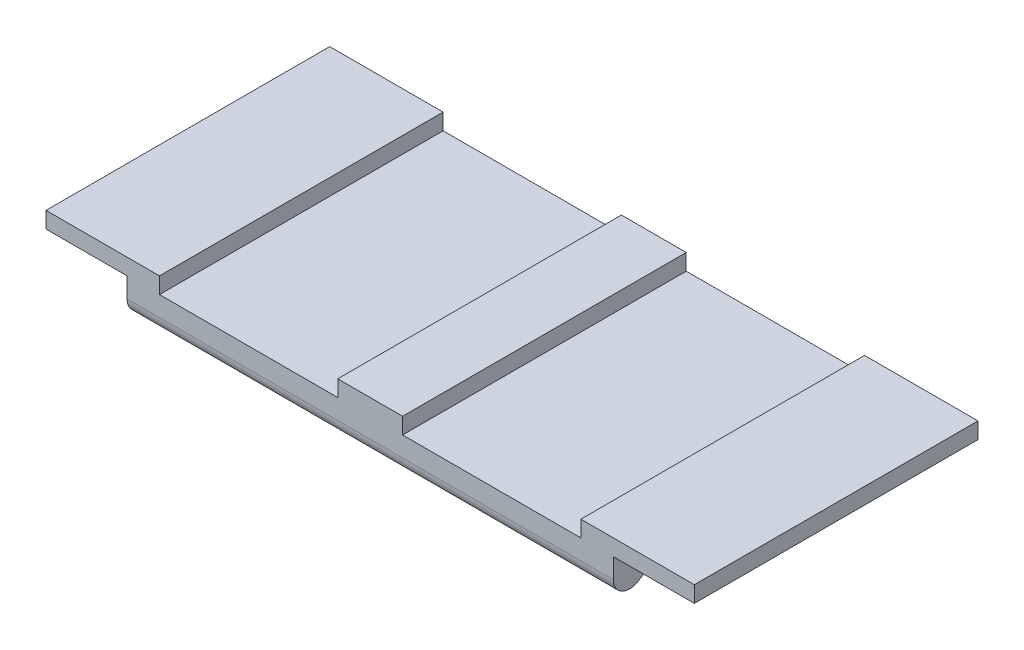
ISO-10303-21;
HEADER;
FILE_DESCRIPTION(('STEP AP214'),'2;1');
FILE_NAME('part.step','',(''),(''),'','','');
FILE_SCHEMA(('AUTOMOTIVE_DESIGN { 1 0 10303 214 1 1 1 1 }'));
ENDSEC;
DATA;
#1=APPLICATION_CONTEXT('core data for automotive mechanical design processes');
#2=APPLICATION_PROTOCOL_DEFINITION('international standard','automotive_design',2000,#1);
#3=PRODUCT_CONTEXT('',#1,'mechanical');
#4=PRODUCT('Part','Part','',(#3));
#5=PRODUCT_RELATED_PRODUCT_CATEGORY('part','',(#4));
#6=PRODUCT_DEFINITION_FORMATION('','',#4);
#7=PRODUCT_DEFINITION_CONTEXT('part definition',#1,'design');
#8=PRODUCT_DEFINITION('design','',#6,#7);
#9=PRODUCT_DEFINITION_SHAPE('','',#8);
#10=(LENGTH_UNIT() NAMED_UNIT(*) SI_UNIT(.MILLI.,.METRE.));
#11=(NAMED_UNIT(*) PLANE_ANGLE_UNIT() SI_UNIT($,.RADIAN.));
#12=(NAMED_UNIT(*) SI_UNIT($,.STERADIAN.) SOLID_ANGLE_UNIT());
#13=UNCERTAINTY_MEASURE_WITH_UNIT(LENGTH_MEASURE(1.E-05),#10,'distance_accuracy_value','');
#14=(GEOMETRIC_REPRESENTATION_CONTEXT(3) GLOBAL_UNCERTAINTY_ASSIGNED_CONTEXT((#13)) GLOBAL_UNIT_ASSIGNED_CONTEXT((#10,
#11,#12)) REPRESENTATION_CONTEXT('',''));
#15=CARTESIAN_POINT('',(0.,0.,0.));
#16=DIRECTION('',(0.,0.,1.));
#17=DIRECTION('',(1.,0.,0.));
#18=AXIS2_PLACEMENT_3D('',#15,#16,#17);
#19=CARTESIAN_POINT('',(30.,-8.,17.5));
#20=DIRECTION('',(1.,0.,0.));
#21=DIRECTION('',(0.,0.,-1.));
#22=AXIS2_PLACEMENT_3D('',#19,#20,#21);
#23=PLANE('',#22);
#24=DIRECTION('',(0.,1.,0.));
#25=VECTOR('',#24,1.);
#26=CARTESIAN_POINT('',(30.,-8.,-17.5));
#27=LINE('',#26,#25);
#28=CARTESIAN_POINT('',(30.,-4.46761924206188,-17.5));
#29=VERTEX_POINT('',#28);
#30=CARTESIAN_POINT('',(30.,-2.,-17.5));
#31=VERTEX_POINT('',#30);
#32=EDGE_CURVE('E309',#29,#31,#27,.T.);
#33=ORIENTED_EDGE('',*,*,#32,.T.);
#34=DIRECTION('',(0.,0.,1.));
#35=VECTOR('',#34,1.);
#36=CARTESIAN_POINT('',(30.,-2.,0.));
#37=LINE('',#36,#35);
#38=CARTESIAN_POINT('',(30.,-2.,17.5));
#39=VERTEX_POINT('',#38);
#40=EDGE_CURVE('E206',#31,#39,#37,.T.);
#41=ORIENTED_EDGE('',*,*,#40,.T.);
#42=DIRECTION('',(0.,1.,0.));
#43=VECTOR('',#42,1.);
#44=CARTESIAN_POINT('',(30.,-8.,17.5));
#45=LINE('',#44,#43);
#46=CARTESIAN_POINT('',(30.,-4.46761924206188,17.5));
#47=VERTEX_POINT('',#46);
#48=EDGE_CURVE('E312',#47,#39,#45,.T.);
#49=ORIENTED_EDGE('',*,*,#48,.F.);
#50=CARTESIAN_POINT('',(30.,-4.46761924206188,15.5));
#51=DIRECTION('',(1.,0.,0.));
#52=DIRECTION('',(0.,0.,-1.));
#53=AXIS2_PLACEMENT_3D('',#50,#51,#52);
#54=CIRCLE('',#53,2.);
#55=CARTESIAN_POINT('',(30.,-6.18260509348697,14.4710084891449));
#56=VERTEX_POINT('',#55);
#57=EDGE_CURVE('E339',#47,#56,#54,.T.);
#58=ORIENTED_EDGE('',*,*,#57,.T.);
#59=DIRECTION('',(0.,0.514495755427526,-0.857492925712544));
#60=VECTOR('',#59,1.);
#61=CARTESIAN_POINT('',(30.,-8.,17.5));
#62=LINE('',#61,#60);
#63=CARTESIAN_POINT('',(30.,-5.28501414857491,12.9750235809582));
#64=VERTEX_POINT('',#63);
#65=EDGE_CURVE('E299',#56,#64,#62,.T.);
#66=ORIENTED_EDGE('',*,*,#65,.T.);
#67=CARTESIAN_POINT('',(30.,-7.,11.9460320701031));
#68=DIRECTION('',(1.,0.,0.));
#69=DIRECTION('',(0.,0.,-1.));
#70=AXIS2_PLACEMENT_3D('',#67,#68,#69);
#71=CIRCLE('',#70,2.);
#72=CARTESIAN_POINT('',(30.,-5.,11.9460320701031));
#73=VERTEX_POINT('',#72);
#74=EDGE_CURVE('E346',#64,#73,#71,.F.);
#75=ORIENTED_EDGE('',*,*,#74,.T.);
#76=DIRECTION('',(0.,0.,-1.));
#77=VECTOR('',#76,1.);
#78=CARTESIAN_POINT('',(30.,-5.,17.5));
#79=LINE('',#78,#77);
#80=CARTESIAN_POINT('',(30.,-5.,-11.9460320701031));
#81=VERTEX_POINT('',#80);
#82=EDGE_CURVE('E308',#73,#81,#79,.T.);
#83=ORIENTED_EDGE('',*,*,#82,.T.);
#84=CARTESIAN_POINT('',(30.,-7.,-11.9460320701031));
#85=DIRECTION('',(1.,0.,0.));
#86=DIRECTION('',(0.,0.,-1.));
#87=AXIS2_PLACEMENT_3D('',#84,#85,#86);
#88=CIRCLE('',#87,2.);
#89=CARTESIAN_POINT('',(30.,-5.28501414857491,-12.9750235809582));
#90=VERTEX_POINT('',#89);
#91=EDGE_CURVE('E41',#81,#90,#88,.F.);
#92=ORIENTED_EDGE('',*,*,#91,.T.);
#93=DIRECTION('',(0.,0.514495755427527,0.857492925712544));
#94=VECTOR('',#93,1.);
#95=CARTESIAN_POINT('',(30.,7.44117647058825,8.23529411764705));
#96=LINE('',#95,#94);
#97=CARTESIAN_POINT('',(30.,-6.18260509348696,-14.471008489145));
#98=VERTEX_POINT('',#97);
#99=EDGE_CURVE('E296',#98,#90,#96,.T.);
#100=ORIENTED_EDGE('',*,*,#99,.F.);
#101=CARTESIAN_POINT('',(30.,-4.46761924206188,-15.5));
#102=DIRECTION('',(1.,0.,0.));
#103=DIRECTION('',(0.,0.,-1.));
#104=AXIS2_PLACEMENT_3D('',#101,#102,#103);
#105=CIRCLE('',#104,2.);
#106=EDGE_CURVE('E341',#98,#29,#105,.T.);
#107=ORIENTED_EDGE('',*,*,#106,.T.);
#108=EDGE_LOOP('',(#33,#41,#49,#58,#66,#75,#83,#92,#100,#107));
#109=FACE_BOUND('',#108,.T.);
#110=ADVANCED_FACE('F33',(#109),#23,.T.);
#111=CARTESIAN_POINT('',(30.,-8.,-17.5));
#112=DIRECTION('',(0.,0.,-1.));
#113=DIRECTION('',(-1.,0.,0.));
#114=AXIS2_PLACEMENT_3D('',#111,#112,#113);
#115=PLANE('',#114);
#116=DIRECTION('',(1.,0.,0.));
#117=VECTOR('',#116,1.);
#118=CARTESIAN_POINT('',(0.,-2.,-17.5));
#119=LINE('',#118,#117);
#120=CARTESIAN_POINT('',(-26.,-2.,-17.5));
#121=VERTEX_POINT('',#120);
#122=CARTESIAN_POINT('',(-4.,-2.,-17.5));
#123=VERTEX_POINT('',#122);
#124=EDGE_CURVE('E245',#121,#123,#119,.T.);
#125=ORIENTED_EDGE('',*,*,#124,.T.);
#126=DIRECTION('',(0.,-1.,0.));
#127=VECTOR('',#126,1.);
#128=CARTESIAN_POINT('',(-4.,0.,-17.5));
#129=LINE('',#128,#127);
#130=CARTESIAN_POINT('',(-4.,0.,-17.5));
#131=VERTEX_POINT('',#130);
#132=EDGE_CURVE('E239',#131,#123,#129,.T.);
#133=ORIENTED_EDGE('',*,*,#132,.F.);
#134=DIRECTION('',(-1.,0.,0.));
#135=VECTOR('',#134,1.);
#136=CARTESIAN_POINT('',(30.,0.,-17.5));
#137=LINE('',#136,#135);
#138=CARTESIAN_POINT('',(3.99999999999999,0.,-17.5));
#139=VERTEX_POINT('',#138);
#140=EDGE_CURVE('E196',#139,#131,#137,.T.);
#141=ORIENTED_EDGE('',*,*,#140,.F.);
#142=DIRECTION('',(0.,-1.,0.));
#143=VECTOR('',#142,1.);
#144=CARTESIAN_POINT('',(3.99999999999999,0.,-17.5));
#145=LINE('',#144,#143);
#146=CARTESIAN_POINT('',(3.99999999999999,-2.,-17.5));
#147=VERTEX_POINT('',#146);
#148=EDGE_CURVE('E267',#139,#147,#145,.T.);
#149=ORIENTED_EDGE('',*,*,#148,.T.);
#150=DIRECTION('',(-1.,0.,0.));
#151=VECTOR('',#150,1.);
#152=CARTESIAN_POINT('',(0.,-2.,-17.5));
#153=LINE('',#152,#151);
#154=CARTESIAN_POINT('',(26.,-2.,-17.5));
#155=VERTEX_POINT('',#154);
#156=EDGE_CURVE('E271',#155,#147,#153,.T.);
#157=ORIENTED_EDGE('',*,*,#156,.F.);
#158=DIRECTION('',(0.,-1.,0.));
#159=VECTOR('',#158,1.);
#160=CARTESIAN_POINT('',(26.,0.,-17.5));
#161=LINE('',#160,#159);
#162=CARTESIAN_POINT('',(26.,0.,-17.5));
#163=VERTEX_POINT('',#162);
#164=EDGE_CURVE('E191',#163,#155,#161,.T.);
#165=ORIENTED_EDGE('',*,*,#164,.F.);
#166=CARTESIAN_POINT('',(40.,0.,-17.5));
#167=VERTEX_POINT('',#166);
#168=EDGE_CURVE('E184',#167,#163,#137,.T.);
#169=ORIENTED_EDGE('',*,*,#168,.F.);
#170=DIRECTION('',(0.,-1.,0.));
#171=VECTOR('',#170,1.);
#172=CARTESIAN_POINT('',(40.,0.,-17.5));
#173=LINE('',#172,#171);
#174=CARTESIAN_POINT('',(40.,-2.,-17.5));
#175=VERTEX_POINT('',#174);
#176=EDGE_CURVE('E188',#167,#175,#173,.T.);
#177=ORIENTED_EDGE('',*,*,#176,.T.);
#178=DIRECTION('',(-1.,0.,0.));
#179=VECTOR('',#178,1.);
#180=CARTESIAN_POINT('',(40.,-2.,-17.5));
#181=LINE('',#180,#179);
#182=EDGE_CURVE('E216',#175,#31,#181,.T.);
#183=ORIENTED_EDGE('',*,*,#182,.T.);
#184=ORIENTED_EDGE('',*,*,#32,.F.);
#185=DIRECTION('',(-1.,0.,0.));
#186=VECTOR('',#185,1.);
#187=CARTESIAN_POINT('',(-30.,-4.46761924206187,-17.5));
#188=LINE('',#187,#186);
#189=CARTESIAN_POINT('',(-30.,-4.46761924206187,-17.5));
#190=VERTEX_POINT('',#189);
#191=EDGE_CURVE('E332',#29,#190,#188,.T.);
#192=ORIENTED_EDGE('',*,*,#191,.T.);
#193=DIRECTION('',(0.,1.,0.));
#194=VECTOR('',#193,1.);
#195=CARTESIAN_POINT('',(-30.,-8.,-17.5));
#196=LINE('',#195,#194);
#197=CARTESIAN_POINT('',(-30.,-2.,-17.5));
#198=VERTEX_POINT('',#197);
#199=EDGE_CURVE('E306',#190,#198,#196,.T.);
#200=ORIENTED_EDGE('',*,*,#199,.T.);
#201=DIRECTION('',(1.,0.,0.));
#202=VECTOR('',#201,1.);
#203=CARTESIAN_POINT('',(-40.,-2.,-17.5));
#204=LINE('',#203,#202);
#205=CARTESIAN_POINT('',(-40.,-2.,-17.5));
#206=VERTEX_POINT('',#205);
#207=EDGE_CURVE('E235',#206,#198,#204,.T.);
#208=ORIENTED_EDGE('',*,*,#207,.F.);
#209=DIRECTION('',(0.,-1.,0.));
#210=VECTOR('',#209,1.);
#211=CARTESIAN_POINT('',(-40.,0.,-17.5));
#212=LINE('',#211,#210);
#213=CARTESIAN_POINT('',(-40.,0.,-17.5));
#214=VERTEX_POINT('',#213);
#215=EDGE_CURVE('E220',#214,#206,#212,.T.);
#216=ORIENTED_EDGE('',*,*,#215,.F.);
#217=CARTESIAN_POINT('',(-26.,0.,-17.5));
#218=VERTEX_POINT('',#217);
#219=EDGE_CURVE('E198',#218,#214,#137,.T.);
#220=ORIENTED_EDGE('',*,*,#219,.F.);
#221=DIRECTION('',(0.,-1.,0.));
#222=VECTOR('',#221,1.);
#223=CARTESIAN_POINT('',(-26.,0.,-17.5));
#224=LINE('',#223,#222);
#225=EDGE_CURVE('E241',#218,#121,#224,.T.);
#226=ORIENTED_EDGE('',*,*,#225,.T.);
#227=EDGE_LOOP('',(#125,#133,#141,#149,#157,#165,#169,#177,#183,#184,#192,#200,#208,#216,#220,#226));
#228=FACE_BOUND('',#227,.T.);
#229=ADVANCED_FACE('F187',(#228),#115,.T.);
#230=CARTESIAN_POINT('',(30.,-8.,17.5));
#231=DIRECTION('',(0.,0.,1.));
#232=DIRECTION('',(1.,0.,0.));
#233=AXIS2_PLACEMENT_3D('',#230,#231,#232);
#234=PLANE('',#233);
#235=DIRECTION('',(1.,0.,0.));
#236=VECTOR('',#235,1.);
#237=CARTESIAN_POINT('',(30.,0.,17.5));
#238=LINE('',#237,#236);
#239=CARTESIAN_POINT('',(-4.,0.,17.5));
#240=VERTEX_POINT('',#239);
#241=CARTESIAN_POINT('',(3.99999999999999,0.,17.5));
#242=VERTEX_POINT('',#241);
#243=EDGE_CURVE('E304',#240,#242,#238,.T.);
#244=ORIENTED_EDGE('',*,*,#243,.F.);
#245=DIRECTION('',(0.,-1.,0.));
#246=VECTOR('',#245,1.);
#247=CARTESIAN_POINT('',(-4.,0.,17.5));
#248=LINE('',#247,#246);
#249=CARTESIAN_POINT('',(-4.,-2.,17.5));
#250=VERTEX_POINT('',#249);
#251=EDGE_CURVE('E248',#240,#250,#248,.T.);
#252=ORIENTED_EDGE('',*,*,#251,.T.);
#253=DIRECTION('',(1.,0.,0.));
#254=VECTOR('',#253,1.);
#255=CARTESIAN_POINT('',(0.,-2.,17.5));
#256=LINE('',#255,#254);
#257=CARTESIAN_POINT('',(-26.,-2.,17.5));
#258=VERTEX_POINT('',#257);
#259=EDGE_CURVE('E242',#258,#250,#256,.T.);
#260=ORIENTED_EDGE('',*,*,#259,.F.);
#261=DIRECTION('',(0.,-1.,0.));
#262=VECTOR('',#261,1.);
#263=CARTESIAN_POINT('',(-26.,0.,17.5));
#264=LINE('',#263,#262);
#265=CARTESIAN_POINT('',(-26.,0.,17.5));
#266=VERTEX_POINT('',#265);
#267=EDGE_CURVE('E251',#266,#258,#264,.T.);
#268=ORIENTED_EDGE('',*,*,#267,.F.);
#269=CARTESIAN_POINT('',(-40.,0.,17.5));
#270=VERTEX_POINT('',#269);
#271=EDGE_CURVE('E302',#270,#266,#238,.T.);
#272=ORIENTED_EDGE('',*,*,#271,.F.);
#273=DIRECTION('',(0.,1.,0.));
#274=VECTOR('',#273,1.);
#275=CARTESIAN_POINT('',(-40.,0.,17.5));
#276=LINE('',#275,#274);
#277=CARTESIAN_POINT('',(-40.,-2.,17.5));
#278=VERTEX_POINT('',#277);
#279=EDGE_CURVE('E225',#278,#270,#276,.T.);
#280=ORIENTED_EDGE('',*,*,#279,.F.);
#281=DIRECTION('',(1.,0.,0.));
#282=VECTOR('',#281,1.);
#283=CARTESIAN_POINT('',(-40.,-2.,17.5));
#284=LINE('',#283,#282);
#285=CARTESIAN_POINT('',(-30.,-2.,17.5));
#286=VERTEX_POINT('',#285);
#287=EDGE_CURVE('E231',#278,#286,#284,.T.);
#288=ORIENTED_EDGE('',*,*,#287,.T.);
#289=DIRECTION('',(0.,1.,0.));
#290=VECTOR('',#289,1.);
#291=CARTESIAN_POINT('',(-30.,-8.,17.5));
#292=LINE('',#291,#290);
#293=CARTESIAN_POINT('',(-30.,-4.46761924206188,17.5));
#294=VERTEX_POINT('',#293);
#295=EDGE_CURVE('E195',#294,#286,#292,.T.);
#296=ORIENTED_EDGE('',*,*,#295,.F.);
#297=DIRECTION('',(1.,0.,0.));
#298=VECTOR('',#297,1.);
#299=CARTESIAN_POINT('',(30.,-4.46761924206188,17.5));
#300=LINE('',#299,#298);
#301=EDGE_CURVE('E343',#294,#47,#300,.T.);
#302=ORIENTED_EDGE('',*,*,#301,.T.);
#303=ORIENTED_EDGE('',*,*,#48,.T.);
#304=DIRECTION('',(-1.,0.,0.));
#305=VECTOR('',#304,1.);
#306=CARTESIAN_POINT('',(40.,-2.,17.5));
#307=LINE('',#306,#305);
#308=CARTESIAN_POINT('',(40.,-2.,17.5));
#309=VERTEX_POINT('',#308);
#310=EDGE_CURVE('E48',#309,#39,#307,.T.);
#311=ORIENTED_EDGE('',*,*,#310,.F.);
#312=DIRECTION('',(0.,1.,0.));
#313=VECTOR('',#312,1.);
#314=CARTESIAN_POINT('',(40.,0.,17.5));
#315=LINE('',#314,#313);
#316=CARTESIAN_POINT('',(40.,0.,17.5));
#317=VERTEX_POINT('',#316);
#318=EDGE_CURVE('E211',#309,#317,#315,.T.);
#319=ORIENTED_EDGE('',*,*,#318,.T.);
#320=CARTESIAN_POINT('',(26.,0.,17.5));
#321=VERTEX_POINT('',#320);
#322=EDGE_CURVE('E210',#321,#317,#238,.T.);
#323=ORIENTED_EDGE('',*,*,#322,.F.);
#324=DIRECTION('',(0.,-1.,0.));
#325=VECTOR('',#324,1.);
#326=CARTESIAN_POINT('',(26.,0.,17.5));
#327=LINE('',#326,#325);
#328=CARTESIAN_POINT('',(26.,-2.,17.5));
#329=VERTEX_POINT('',#328);
#330=EDGE_CURVE('E238',#321,#329,#327,.T.);
#331=ORIENTED_EDGE('',*,*,#330,.T.);
#332=DIRECTION('',(-1.,0.,0.));
#333=VECTOR('',#332,1.);
#334=CARTESIAN_POINT('',(0.,-2.,17.5));
#335=LINE('',#334,#333);
#336=CARTESIAN_POINT('',(3.99999999999999,-2.,17.5));
#337=VERTEX_POINT('',#336);
#338=EDGE_CURVE('E268',#329,#337,#335,.T.);
#339=ORIENTED_EDGE('',*,*,#338,.T.);
#340=DIRECTION('',(0.,-1.,0.));
#341=VECTOR('',#340,1.);
#342=CARTESIAN_POINT('',(3.99999999999999,0.,17.5));
#343=LINE('',#342,#341);
#344=EDGE_CURVE('E276',#242,#337,#343,.T.);
#345=ORIENTED_EDGE('',*,*,#344,.F.);
#346=EDGE_LOOP('',(#244,#252,#260,#268,#272,#280,#288,#296,#302,#303,#311,#319,#323,#331,#339,#345));
#347=FACE_BOUND('',#346,.T.);
#348=ADVANCED_FACE('F382',(#347),#234,.T.);
#349=CARTESIAN_POINT('',(0.,0.,0.));
#350=DIRECTION('',(0.,1.,0.));
#351=DIRECTION('',(0.,0.,1.));
#352=AXIS2_PLACEMENT_3D('',#349,#350,#351);
#353=PLANE('',#352);
#354=ORIENTED_EDGE('',*,*,#140,.T.);
#355=DIRECTION('',(0.,0.,1.));
#356=VECTOR('',#355,1.);
#357=CARTESIAN_POINT('',(-4.,0.,-17.5));
#358=LINE('',#357,#356);
#359=EDGE_CURVE('E247',#131,#240,#358,.T.);
#360=ORIENTED_EDGE('',*,*,#359,.T.);
#361=ORIENTED_EDGE('',*,*,#243,.T.);
#362=DIRECTION('',(0.,0.,1.));
#363=VECTOR('',#362,1.);
#364=CARTESIAN_POINT('',(3.99999999999999,0.,-17.5));
#365=LINE('',#364,#363);
#366=EDGE_CURVE('E285',#139,#242,#365,.T.);
#367=ORIENTED_EDGE('',*,*,#366,.F.);
#368=EDGE_LOOP('',(#354,#360,#361,#367));
#369=FACE_BOUND('',#368,.T.);
#370=ADVANCED_FACE('F400',(#369),#353,.T.);
#371=ORIENTED_EDGE('',*,*,#168,.T.);
#372=DIRECTION('',(0.,0.,1.));
#373=VECTOR('',#372,1.);
#374=CARTESIAN_POINT('',(26.,0.,-17.5));
#375=LINE('',#374,#373);
#376=EDGE_CURVE('E273',#163,#321,#375,.T.);
#377=ORIENTED_EDGE('',*,*,#376,.T.);
#378=ORIENTED_EDGE('',*,*,#322,.T.);
#379=DIRECTION('',(0.,0.,-1.));
#380=VECTOR('',#379,1.);
#381=CARTESIAN_POINT('',(40.,0.,0.));
#382=LINE('',#381,#380);
#383=EDGE_CURVE('E203',#317,#167,#382,.T.);
#384=ORIENTED_EDGE('',*,*,#383,.T.);
#385=EDGE_LOOP('',(#371,#377,#378,#384));
#386=FACE_BOUND('',#385,.T.);
#387=ADVANCED_FACE('F208',(#386),#353,.T.);
#388=CARTESIAN_POINT('',(-30.,-8.,17.5));
#389=DIRECTION('',(-1.,0.,0.));
#390=DIRECTION('',(0.,0.,1.));
#391=AXIS2_PLACEMENT_3D('',#388,#389,#390);
#392=PLANE('',#391);
#393=DIRECTION('',(0.,0.,1.));
#394=VECTOR('',#393,1.);
#395=CARTESIAN_POINT('',(-30.,-2.,0.));
#396=LINE('',#395,#394);
#397=EDGE_CURVE('E56',#198,#286,#396,.T.);
#398=ORIENTED_EDGE('',*,*,#397,.F.);
#399=ORIENTED_EDGE('',*,*,#199,.F.);
#400=CARTESIAN_POINT('',(-30.,-4.46761924206187,-15.5));
#401=DIRECTION('',(-1.,0.,0.));
#402=DIRECTION('',(0.,0.,1.));
#403=AXIS2_PLACEMENT_3D('',#400,#401,#402);
#404=CIRCLE('',#403,2.);
#405=CARTESIAN_POINT('',(-30.,-6.18260509348696,-14.4710084891449));
#406=VERTEX_POINT('',#405);
#407=EDGE_CURVE('E337',#190,#406,#404,.T.);
#408=ORIENTED_EDGE('',*,*,#407,.T.);
#409=DIRECTION('',(0.,0.514495755427527,0.857492925712544));
#410=VECTOR('',#409,1.);
#411=CARTESIAN_POINT('',(-30.,1.83823529411765,-1.10294117647059));
#412=LINE('',#411,#410);
#413=CARTESIAN_POINT('',(-30.,-5.28501414857491,-12.9750235809582));
#414=VERTEX_POINT('',#413);
#415=EDGE_CURVE('E259',#406,#414,#412,.T.);
#416=ORIENTED_EDGE('',*,*,#415,.T.);
#417=CARTESIAN_POINT('',(-30.,-7.,-11.9460320701031));
#418=DIRECTION('',(-1.,0.,0.));
#419=DIRECTION('',(0.,0.,1.));
#420=AXIS2_PLACEMENT_3D('',#417,#418,#419);
#421=CIRCLE('',#420,2.);
#422=CARTESIAN_POINT('',(-30.,-5.,-11.9460320701031));
#423=VERTEX_POINT('',#422);
#424=EDGE_CURVE('E11',#414,#423,#421,.F.);
#425=ORIENTED_EDGE('',*,*,#424,.T.);
#426=DIRECTION('',(0.,0.,-1.));
#427=VECTOR('',#426,1.);
#428=CARTESIAN_POINT('',(-30.,-5.,0.));
#429=LINE('',#428,#427);
#430=CARTESIAN_POINT('',(-30.,-5.,11.9460320701031));
#431=VERTEX_POINT('',#430);
#432=EDGE_CURVE('E290',#431,#423,#429,.T.);
#433=ORIENTED_EDGE('',*,*,#432,.F.);
#434=CARTESIAN_POINT('',(-30.,-7.,11.9460320701031));
#435=DIRECTION('',(-1.,0.,0.));
#436=DIRECTION('',(0.,0.,1.));
#437=AXIS2_PLACEMENT_3D('',#434,#435,#436);
#438=CIRCLE('',#437,2.);
#439=CARTESIAN_POINT('',(-30.,-5.28501414857491,12.9750235809582));
#440=VERTEX_POINT('',#439);
#441=EDGE_CURVE('E348',#431,#440,#438,.F.);
#442=ORIENTED_EDGE('',*,*,#441,.T.);
#443=DIRECTION('',(0.,0.514495755427526,-0.857492925712544));
#444=VECTOR('',#443,1.);
#445=CARTESIAN_POINT('',(-30.,1.83823529411765,1.10294117647059));
#446=LINE('',#445,#444);
#447=CARTESIAN_POINT('',(-30.,-6.18260509348697,14.471008489145));
#448=VERTEX_POINT('',#447);
#449=EDGE_CURVE('E293',#448,#440,#446,.T.);
#450=ORIENTED_EDGE('',*,*,#449,.F.);
#451=CARTESIAN_POINT('',(-30.,-4.46761924206188,15.5));
#452=DIRECTION('',(-1.,0.,0.));
#453=DIRECTION('',(0.,0.,1.));
#454=AXIS2_PLACEMENT_3D('',#451,#452,#453);
#455=CIRCLE('',#454,2.);
#456=EDGE_CURVE('E335',#448,#294,#455,.T.);
#457=ORIENTED_EDGE('',*,*,#456,.T.);
#458=ORIENTED_EDGE('',*,*,#295,.T.);
#459=EDGE_LOOP('',(#398,#399,#408,#416,#425,#433,#442,#450,#457,#458));
#460=FACE_BOUND('',#459,.T.);
#461=ADVANCED_FACE('F363',(#460),#392,.T.);
#462=DIRECTION('',(0.,0.,1.));
#463=VECTOR('',#462,1.);
#464=CARTESIAN_POINT('',(-26.,0.,-17.5));
#465=LINE('',#464,#463);
#466=EDGE_CURVE('E262',#218,#266,#465,.T.);
#467=ORIENTED_EDGE('',*,*,#466,.F.);
#468=ORIENTED_EDGE('',*,*,#219,.T.);
#469=DIRECTION('',(0.,0.,-1.));
#470=VECTOR('',#469,1.);
#471=CARTESIAN_POINT('',(-40.,0.,0.));
#472=LINE('',#471,#470);
#473=EDGE_CURVE('E228',#270,#214,#472,.T.);
#474=ORIENTED_EDGE('',*,*,#473,.F.);
#475=ORIENTED_EDGE('',*,*,#271,.T.);
#476=EDGE_LOOP('',(#467,#468,#474,#475));
#477=FACE_BOUND('',#476,.T.);
#478=ADVANCED_FACE('F411',(#477),#353,.T.);
#479=CARTESIAN_POINT('',(-30.,1.83823529411765,1.10294117647059));
#480=DIRECTION('',(0.,-0.857492925712544,-0.514495755427526));
#481=DIRECTION('',(0.,0.514495755427526,-0.857492925712544));
#482=AXIS2_PLACEMENT_3D('',#479,#480,#481);
#483=PLANE('',#482);
#484=ORIENTED_EDGE('',*,*,#449,.T.);
#485=DIRECTION('',(1.,0.,0.));
#486=VECTOR('',#485,1.);
#487=CARTESIAN_POINT('',(30.,-5.28501414857491,12.9750235809582));
#488=LINE('',#487,#486);
#489=EDGE_CURVE('E320',#440,#64,#488,.T.);
#490=ORIENTED_EDGE('',*,*,#489,.T.);
#491=ORIENTED_EDGE('',*,*,#65,.F.);
#492=DIRECTION('',(1.,0.,0.));
#493=VECTOR('',#492,1.);
#494=CARTESIAN_POINT('',(-30.,-6.18260509348697,14.471008489145));
#495=LINE('',#494,#493);
#496=EDGE_CURVE('E318',#56,#448,#495,.F.);
#497=ORIENTED_EDGE('',*,*,#496,.T.);
#498=EDGE_LOOP('',(#484,#490,#491,#497));
#499=FACE_BOUND('',#498,.T.);
#500=ADVANCED_FACE('F374',(#499),#483,.T.);
#501=CARTESIAN_POINT('',(-30.,-5.,0.));
#502=DIRECTION('',(0.,-1.,0.));
#503=DIRECTION('',(0.,0.,-1.));
#504=AXIS2_PLACEMENT_3D('',#501,#502,#503);
#505=PLANE('',#504);
#506=ORIENTED_EDGE('',*,*,#82,.F.);
#507=DIRECTION('',(1.,0.,0.));
#508=VECTOR('',#507,1.);
#509=CARTESIAN_POINT('',(-30.,-5.,11.9460320701031));
#510=LINE('',#509,#508);
#511=EDGE_CURVE('E326',#73,#431,#510,.F.);
#512=ORIENTED_EDGE('',*,*,#511,.T.);
#513=ORIENTED_EDGE('',*,*,#432,.T.);
#514=DIRECTION('',(1.,0.,0.));
#515=VECTOR('',#514,1.);
#516=CARTESIAN_POINT('',(-30.,-5.,-11.9460320701031));
#517=LINE('',#516,#515);
#518=EDGE_CURVE('E323',#423,#81,#517,.T.);
#519=ORIENTED_EDGE('',*,*,#518,.T.);
#520=EDGE_LOOP('',(#506,#512,#513,#519));
#521=FACE_BOUND('',#520,.T.);
#522=ADVANCED_FACE('F366',(#521),#505,.T.);
#523=CARTESIAN_POINT('',(-30.,1.83823529411765,-1.10294117647059));
#524=DIRECTION('',(0.,0.857492925712544,-0.514495755427527));
#525=DIRECTION('',(0.,0.514495755427527,0.857492925712544));
#526=AXIS2_PLACEMENT_3D('',#523,#524,#525);
#527=PLANE('',#526);
#528=ORIENTED_EDGE('',*,*,#99,.T.);
#529=DIRECTION('',(1.,0.,0.));
#530=VECTOR('',#529,1.);
#531=CARTESIAN_POINT('',(-30.,-5.28501414857491,-12.9750235809582));
#532=LINE('',#531,#530);
#533=EDGE_CURVE('E330',#90,#414,#532,.F.);
#534=ORIENTED_EDGE('',*,*,#533,.T.);
#535=ORIENTED_EDGE('',*,*,#415,.F.);
#536=DIRECTION('',(-1.,0.,0.));
#537=VECTOR('',#536,1.);
#538=CARTESIAN_POINT('',(30.,-6.18260509348697,-14.4710084891449));
#539=LINE('',#538,#537);
#540=EDGE_CURVE('E328',#406,#98,#539,.F.);
#541=ORIENTED_EDGE('',*,*,#540,.T.);
#542=EDGE_LOOP('',(#528,#534,#535,#541));
#543=FACE_BOUND('',#542,.T.);
#544=ADVANCED_FACE('F357',(#543),#527,.F.);
#545=CARTESIAN_POINT('',(-30.,-7.,11.9460320701031));
#546=DIRECTION('',(-1.,0.,0.));
#547=DIRECTION('',(0.,0.,1.));
#548=AXIS2_PLACEMENT_3D('',#545,#546,#547);
#549=CYLINDRICAL_SURFACE('',#548,2.);
#550=ORIENTED_EDGE('',*,*,#441,.F.);
#551=ORIENTED_EDGE('',*,*,#511,.F.);
#552=ORIENTED_EDGE('',*,*,#74,.F.);
#553=ORIENTED_EDGE('',*,*,#489,.F.);
#554=EDGE_LOOP('',(#550,#551,#552,#553));
#555=FACE_BOUND('',#554,.T.);
#556=ADVANCED_FACE('F369',(#555),#549,.F.);
#557=CARTESIAN_POINT('',(-30.,-7.,-11.9460320701031));
#558=DIRECTION('',(1.,0.,0.));
#559=DIRECTION('',(0.,0.,-1.));
#560=AXIS2_PLACEMENT_3D('',#557,#558,#559);
#561=CYLINDRICAL_SURFACE('',#560,2.);
#562=ORIENTED_EDGE('',*,*,#424,.F.);
#563=ORIENTED_EDGE('',*,*,#533,.F.);
#564=ORIENTED_EDGE('',*,*,#91,.F.);
#565=ORIENTED_EDGE('',*,*,#518,.F.);
#566=EDGE_LOOP('',(#562,#563,#564,#565));
#567=FACE_BOUND('',#566,.T.);
#568=ADVANCED_FACE('F361',(#567),#561,.F.);
#569=CARTESIAN_POINT('',(30.,-4.46761924206188,-15.5));
#570=DIRECTION('',(1.,0.,0.));
#571=DIRECTION('',(0.,0.,-1.));
#572=AXIS2_PLACEMENT_3D('',#569,#570,#571);
#573=CYLINDRICAL_SURFACE('',#572,2.);
#574=ORIENTED_EDGE('',*,*,#106,.F.);
#575=ORIENTED_EDGE('',*,*,#540,.F.);
#576=ORIENTED_EDGE('',*,*,#407,.F.);
#577=ORIENTED_EDGE('',*,*,#191,.F.);
#578=EDGE_LOOP('',(#574,#575,#576,#577));
#579=FACE_BOUND('',#578,.T.);
#580=ADVANCED_FACE('F394',(#579),#573,.T.);
#581=CARTESIAN_POINT('',(30.,-4.46761924206188,15.5));
#582=DIRECTION('',(1.,0.,0.));
#583=DIRECTION('',(0.,0.,-1.));
#584=AXIS2_PLACEMENT_3D('',#581,#582,#583);
#585=CYLINDRICAL_SURFACE('',#584,2.);
#586=ORIENTED_EDGE('',*,*,#456,.F.);
#587=ORIENTED_EDGE('',*,*,#496,.F.);
#588=ORIENTED_EDGE('',*,*,#57,.F.);
#589=ORIENTED_EDGE('',*,*,#301,.F.);
#590=EDGE_LOOP('',(#586,#587,#588,#589));
#591=FACE_BOUND('',#590,.T.);
#592=ADVANCED_FACE('F35',(#591),#585,.T.);
#593=CARTESIAN_POINT('',(26.,0.,-17.5));
#594=DIRECTION('',(-1.,0.,0.));
#595=DIRECTION('',(0.,0.,1.));
#596=AXIS2_PLACEMENT_3D('',#593,#594,#595);
#597=PLANE('',#596);
#598=ORIENTED_EDGE('',*,*,#330,.F.);
#599=ORIENTED_EDGE('',*,*,#376,.F.);
#600=ORIENTED_EDGE('',*,*,#164,.T.);
#601=DIRECTION('',(0.,0.,1.));
#602=VECTOR('',#601,1.);
#603=CARTESIAN_POINT('',(26.,-2.,-17.5));
#604=LINE('',#603,#602);
#605=EDGE_CURVE('E252',#155,#329,#604,.T.);
#606=ORIENTED_EDGE('',*,*,#605,.T.);
#607=EDGE_LOOP('',(#598,#599,#600,#606));
#608=FACE_BOUND('',#607,.T.);
#609=ADVANCED_FACE('F442',(#608),#597,.T.);
#610=CARTESIAN_POINT('',(0.,-2.,-17.5));
#611=DIRECTION('',(0.,1.,0.));
#612=DIRECTION('',(0.,0.,1.));
#613=AXIS2_PLACEMENT_3D('',#610,#611,#612);
#614=PLANE('',#613);
#615=ORIENTED_EDGE('',*,*,#338,.F.);
#616=ORIENTED_EDGE('',*,*,#605,.F.);
#617=ORIENTED_EDGE('',*,*,#156,.T.);
#618=DIRECTION('',(0.,0.,1.));
#619=VECTOR('',#618,1.);
#620=CARTESIAN_POINT('',(3.99999999999999,-2.,-17.5));
#621=LINE('',#620,#619);
#622=EDGE_CURVE('E283',#147,#337,#621,.T.);
#623=ORIENTED_EDGE('',*,*,#622,.T.);
#624=EDGE_LOOP('',(#615,#616,#617,#623));
#625=FACE_BOUND('',#624,.T.);
#626=ADVANCED_FACE('F446',(#625),#614,.T.);
#627=CARTESIAN_POINT('',(3.99999999999999,0.,-17.5));
#628=DIRECTION('',(-1.,0.,0.));
#629=DIRECTION('',(0.,-1.,0.));
#630=AXIS2_PLACEMENT_3D('',#627,#628,#629);
#631=PLANE('',#630);
#632=ORIENTED_EDGE('',*,*,#344,.T.);
#633=ORIENTED_EDGE('',*,*,#622,.F.);
#634=ORIENTED_EDGE('',*,*,#148,.F.);
#635=ORIENTED_EDGE('',*,*,#366,.T.);
#636=EDGE_LOOP('',(#632,#633,#634,#635));
#637=FACE_BOUND('',#636,.T.);
#638=ADVANCED_FACE('F406',(#637),#631,.F.);
#639=CARTESIAN_POINT('',(-4.,0.,-17.5));
#640=DIRECTION('',(-1.,0.,0.));
#641=DIRECTION('',(0.,-1.,0.));
#642=AXIS2_PLACEMENT_3D('',#639,#640,#641);
#643=PLANE('',#642);
#644=ORIENTED_EDGE('',*,*,#251,.F.);
#645=ORIENTED_EDGE('',*,*,#359,.F.);
#646=ORIENTED_EDGE('',*,*,#132,.T.);
#647=DIRECTION('',(0.,0.,1.));
#648=VECTOR('',#647,1.);
#649=CARTESIAN_POINT('',(-4.,-2.,-17.5));
#650=LINE('',#649,#648);
#651=EDGE_CURVE('E257',#123,#250,#650,.T.);
#652=ORIENTED_EDGE('',*,*,#651,.T.);
#653=EDGE_LOOP('',(#644,#645,#646,#652));
#654=FACE_BOUND('',#653,.T.);
#655=ADVANCED_FACE('F585',(#654),#643,.T.);
#656=CARTESIAN_POINT('',(0.,-2.,-17.5));
#657=DIRECTION('',(0.,-1.,0.));
#658=DIRECTION('',(0.,0.,-1.));
#659=AXIS2_PLACEMENT_3D('',#656,#657,#658);
#660=PLANE('',#659);
#661=ORIENTED_EDGE('',*,*,#259,.T.);
#662=ORIENTED_EDGE('',*,*,#651,.F.);
#663=ORIENTED_EDGE('',*,*,#124,.F.);
#664=DIRECTION('',(0.,0.,1.));
#665=VECTOR('',#664,1.);
#666=CARTESIAN_POINT('',(-26.,-2.,-17.5));
#667=LINE('',#666,#665);
#668=EDGE_CURVE('E260',#121,#258,#667,.T.);
#669=ORIENTED_EDGE('',*,*,#668,.T.);
#670=EDGE_LOOP('',(#661,#662,#663,#669));
#671=FACE_BOUND('',#670,.T.);
#672=ADVANCED_FACE('F592',(#671),#660,.F.);
#673=CARTESIAN_POINT('',(-26.,0.,-17.5));
#674=DIRECTION('',(-1.,0.,0.));
#675=DIRECTION('',(0.,0.,1.));
#676=AXIS2_PLACEMENT_3D('',#673,#674,#675);
#677=PLANE('',#676);
#678=ORIENTED_EDGE('',*,*,#267,.T.);
#679=ORIENTED_EDGE('',*,*,#668,.F.);
#680=ORIENTED_EDGE('',*,*,#225,.F.);
#681=ORIENTED_EDGE('',*,*,#466,.T.);
#682=EDGE_LOOP('',(#678,#679,#680,#681));
#683=FACE_BOUND('',#682,.T.);
#684=ADVANCED_FACE('F421',(#683),#677,.F.);
#685=CARTESIAN_POINT('',(-40.,-2.,0.));
#686=DIRECTION('',(0.,1.,0.));
#687=DIRECTION('',(0.,0.,1.));
#688=AXIS2_PLACEMENT_3D('',#685,#686,#687);
#689=PLANE('',#688);
#690=ORIENTED_EDGE('',*,*,#397,.T.);
#691=ORIENTED_EDGE('',*,*,#287,.F.);
#692=DIRECTION('',(0.,0.,1.));
#693=VECTOR('',#692,1.);
#694=CARTESIAN_POINT('',(-40.,-2.,0.));
#695=LINE('',#694,#693);
#696=EDGE_CURVE('E223',#206,#278,#695,.T.);
#697=ORIENTED_EDGE('',*,*,#696,.F.);
#698=ORIENTED_EDGE('',*,*,#207,.T.);
#699=EDGE_LOOP('',(#690,#691,#697,#698));
#700=FACE_BOUND('',#699,.T.);
#701=ADVANCED_FACE('F387',(#700),#689,.F.);
#702=CARTESIAN_POINT('',(-40.,0.,0.));
#703=DIRECTION('',(-1.,0.,0.));
#704=DIRECTION('',(0.,0.,1.));
#705=AXIS2_PLACEMENT_3D('',#702,#703,#704);
#706=PLANE('',#705);
#707=ORIENTED_EDGE('',*,*,#215,.T.);
#708=ORIENTED_EDGE('',*,*,#696,.T.);
#709=ORIENTED_EDGE('',*,*,#279,.T.);
#710=ORIENTED_EDGE('',*,*,#473,.T.);
#711=EDGE_LOOP('',(#707,#708,#709,#710));
#712=FACE_BOUND('',#711,.T.);
#713=ADVANCED_FACE('F413',(#712),#706,.T.);
#714=CARTESIAN_POINT('',(40.,-2.,0.));
#715=DIRECTION('',(0.,-1.,0.));
#716=DIRECTION('',(0.,0.,-1.));
#717=AXIS2_PLACEMENT_3D('',#714,#715,#716);
#718=PLANE('',#717);
#719=ORIENTED_EDGE('',*,*,#40,.F.);
#720=ORIENTED_EDGE('',*,*,#182,.F.);
#721=DIRECTION('',(0.,0.,1.));
#722=VECTOR('',#721,1.);
#723=CARTESIAN_POINT('',(40.,-2.,0.));
#724=LINE('',#723,#722);
#725=EDGE_CURVE('E205',#175,#309,#724,.T.);
#726=ORIENTED_EDGE('',*,*,#725,.T.);
#727=ORIENTED_EDGE('',*,*,#310,.T.);
#728=EDGE_LOOP('',(#719,#720,#726,#727));
#729=FACE_BOUND('',#728,.T.);
#730=ADVANCED_FACE('F395',(#729),#718,.T.);
#731=CARTESIAN_POINT('',(40.,0.,0.));
#732=DIRECTION('',(1.,0.,0.));
#733=DIRECTION('',(0.,0.,1.));
#734=AXIS2_PLACEMENT_3D('',#731,#732,#733);
#735=PLANE('',#734);
#736=ORIENTED_EDGE('',*,*,#176,.F.);
#737=ORIENTED_EDGE('',*,*,#383,.F.);
#738=ORIENTED_EDGE('',*,*,#318,.F.);
#739=ORIENTED_EDGE('',*,*,#725,.F.);
#740=EDGE_LOOP('',(#736,#737,#738,#739));
#741=FACE_BOUND('',#740,.T.);
#742=ADVANCED_FACE('F201',(#741),#735,.T.);
#743=CLOSED_SHELL('',(#110,#229,#348,#370,#387,#461,#478,#500,#522,#544,#556,#568,#580,#592,
#609,#626,#638,#655,#672,#684,#701,#713,#730,#742));
#744=MANIFOLD_SOLID_BREP('B2',#743);
#745=ADVANCED_BREP_SHAPE_REPRESENTATION('',(#18,#744),#14);
#746=SHAPE_DEFINITION_REPRESENTATION(#9,#745);
ENDSEC;
END-ISO-10303-21;
